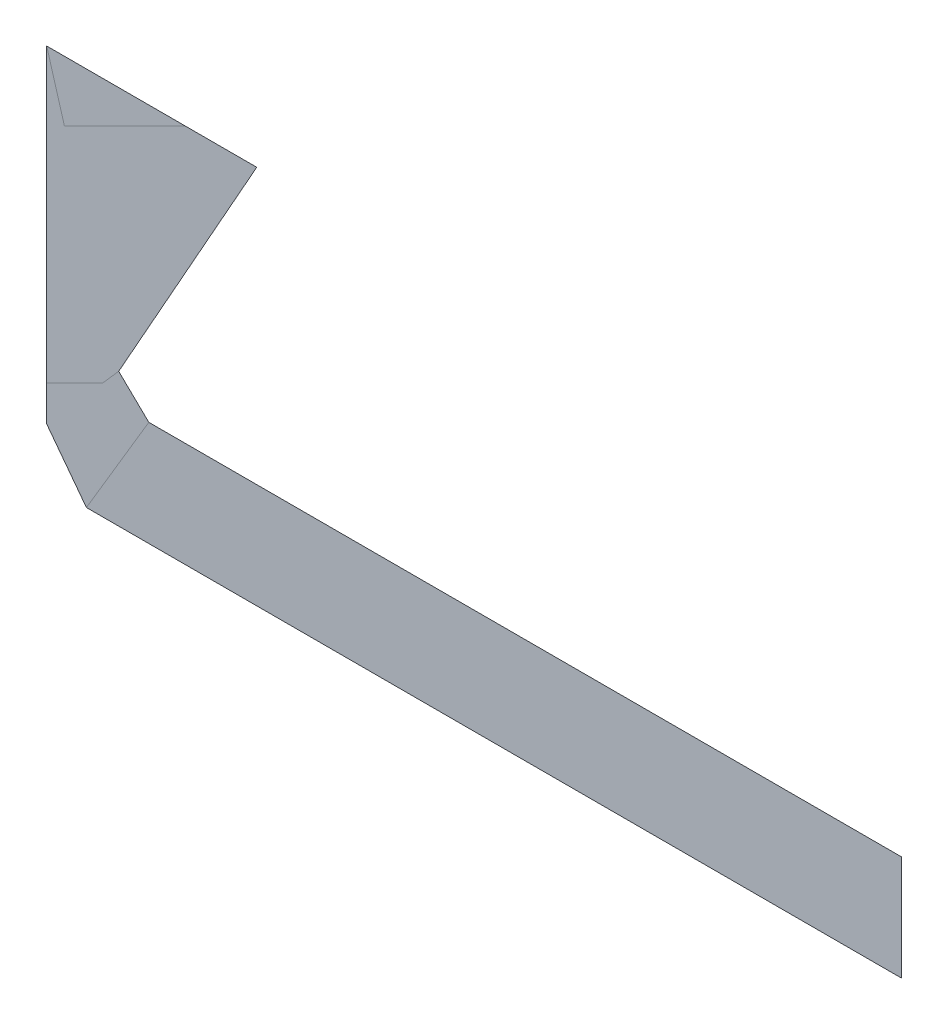
ISO-10303-21;
HEADER;
FILE_DESCRIPTION(('STEP AP214'),'2;1');
FILE_NAME('part.step','',(''),(''),'','','');
FILE_SCHEMA(('AUTOMOTIVE_DESIGN { 1 0 10303 214 1 1 1 1 }'));
ENDSEC;
DATA;
#1=APPLICATION_CONTEXT('core data for automotive mechanical design processes');
#2=APPLICATION_PROTOCOL_DEFINITION('international standard','automotive_design',2000,#1);
#3=PRODUCT_CONTEXT('',#1,'mechanical');
#4=PRODUCT('Part','Part','',(#3));
#5=PRODUCT_RELATED_PRODUCT_CATEGORY('part','',(#4));
#6=PRODUCT_DEFINITION_FORMATION('','',#4);
#7=PRODUCT_DEFINITION_CONTEXT('part definition',#1,'design');
#8=PRODUCT_DEFINITION('design','',#6,#7);
#9=PRODUCT_DEFINITION_SHAPE('','',#8);
#10=(LENGTH_UNIT() NAMED_UNIT(*) SI_UNIT(.MILLI.,.METRE.));
#11=(NAMED_UNIT(*) PLANE_ANGLE_UNIT() SI_UNIT($,.RADIAN.));
#12=(NAMED_UNIT(*) SI_UNIT($,.STERADIAN.) SOLID_ANGLE_UNIT());
#13=UNCERTAINTY_MEASURE_WITH_UNIT(LENGTH_MEASURE(1.E-05),#10,'distance_accuracy_value','');
#14=(GEOMETRIC_REPRESENTATION_CONTEXT(3) GLOBAL_UNCERTAINTY_ASSIGNED_CONTEXT((#13)) GLOBAL_UNIT_ASSIGNED_CONTEXT((#10,
#11,#12)) REPRESENTATION_CONTEXT('',''));
#15=CARTESIAN_POINT('',(0.,0.,0.));
#16=DIRECTION('',(0.,0.,1.));
#17=DIRECTION('',(1.,0.,0.));
#18=AXIS2_PLACEMENT_3D('',#15,#16,#17);
#19=CARTESIAN_POINT('',(5.645839926502,0.703347583591,0.001668));
#20=DIRECTION('',(0.,0.,1.));
#21=DIRECTION('',(1.,0.,0.));
#22=AXIS2_PLACEMENT_3D('',#19,#20,#21);
#23=PLANE('',#22);
#24=CARTESIAN_POINT('',(5.860369157796,0.696738694803,0.001668));
#25=DIRECTION('',(-1.,0.,0.));
#26=VECTOR('',#25,1.);
#27=LINE('',#24,#26);
#28=CARTESIAN_POINT('',(5.860369157796,0.696738694803,0.0015));
#29=VERTEX_POINT('',#28);
#30=CARTESIAN_POINT('',(5.547352927416,0.696738694803,0.0015));
#31=VERTEX_POINT('',#30);
#32=EDGE_CURVE('E138',#29,#31,#27,.T.);
#33=ORIENTED_EDGE('',*,*,#32,.T.);
#34=CARTESIAN_POINT('',(5.547352927416,0.696738694803,0.001668));
#35=DIRECTION('',(-0.718988368379868,0.695022104781175,0.));
#36=VECTOR('',#35,1.);
#37=LINE('',#34,#36);
#38=CARTESIAN_POINT('',(5.534824248743,0.708849751121,0.0015));
#39=VERTEX_POINT('',#38);
#40=EDGE_CURVE('E28',#31,#39,#37,.T.);
#41=ORIENTED_EDGE('',*,*,#40,.T.);
#42=CARTESIAN_POINT('',(5.534824248743,0.708849751121,0.001668));
#43=DIRECTION('',(0.489822399632752,0.871822239231148,0.));
#44=VECTOR('',#43,1.);
#45=LINE('',#42,#44);
#46=CARTESIAN_POINT('',(5.592252953513,0.81106561962,0.0015));
#47=VERTEX_POINT('',#46);
#48=EDGE_CURVE('E11',#39,#47,#45,.T.);
#49=ORIENTED_EDGE('',*,*,#48,.T.);
#50=CARTESIAN_POINT('',(5.592252953513,0.81106561962,0.001668));
#51=DIRECTION('',(-1.,0.,0.));
#52=VECTOR('',#51,1.);
#53=LINE('',#50,#52);
#54=CARTESIAN_POINT('',(5.50488152322,0.81106561962,0.0015));
#55=VERTEX_POINT('',#54);
#56=EDGE_CURVE('E56',#47,#55,#53,.T.);
#57=ORIENTED_EDGE('',*,*,#56,.T.);
#58=CARTESIAN_POINT('',(5.50488152322,0.81106561962,0.001668));
#59=DIRECTION('',(0.,-1.,0.));
#60=VECTOR('',#59,1.);
#61=LINE('',#58,#60);
#62=CARTESIAN_POINT('',(5.50488152322,0.674898417121,0.0015));
#63=VERTEX_POINT('',#62);
#64=EDGE_CURVE('E53',#55,#63,#61,.T.);
#65=ORIENTED_EDGE('',*,*,#64,.T.);
#66=CARTESIAN_POINT('',(5.50488152322,0.674898417121,0.001668));
#67=DIRECTION('',(0.60328667822507,-0.797524409580146,0.));
#68=VECTOR('',#67,1.);
#69=LINE('',#66,#68);
#70=CARTESIAN_POINT('',(5.52140258316,0.653058139439,0.0015));
#71=VERTEX_POINT('',#70);
#72=EDGE_CURVE('E134',#63,#71,#69,.T.);
#73=ORIENTED_EDGE('',*,*,#72,.T.);
#74=CARTESIAN_POINT('',(5.52140258316,0.653058139439,0.001668));
#75=DIRECTION('',(1.,0.,0.));
#76=VECTOR('',#75,1.);
#77=LINE('',#74,#76);
#78=CARTESIAN_POINT('',(5.860369157796,0.653058139439,0.0015));
#79=VERTEX_POINT('',#78);
#80=EDGE_CURVE('E135',#71,#79,#77,.T.);
#81=ORIENTED_EDGE('',*,*,#80,.T.);
#82=CARTESIAN_POINT('',(5.860369157796,0.653058139439,0.001668));
#83=DIRECTION('',(0.,1.,0.));
#84=VECTOR('',#83,1.);
#85=LINE('',#82,#84);
#86=EDGE_CURVE('E136',#79,#29,#85,.T.);
#87=ORIENTED_EDGE('',*,*,#86,.T.);
#88=EDGE_LOOP('',(#33,#41,#49,#57,#65,#73,#81,#87));
#89=FACE_BOUND('',#88,.T.);
#90=ADVANCED_FACE('F17',(#89),#23,.T.);
#91=CARTESIAN_POINT('',(5.645839926502,0.703347583591,0.001332));
#92=DIRECTION('',(0.,0.,1.));
#93=DIRECTION('',(1.,0.,0.));
#94=AXIS2_PLACEMENT_3D('',#91,#92,#93);
#95=PLANE('',#94);
#96=ORIENTED_EDGE('',*,*,#40,.F.);
#97=ORIENTED_EDGE('',*,*,#32,.F.);
#98=ORIENTED_EDGE('',*,*,#86,.F.);
#99=ORIENTED_EDGE('',*,*,#80,.F.);
#100=ORIENTED_EDGE('',*,*,#72,.F.);
#101=ORIENTED_EDGE('',*,*,#64,.F.);
#102=ORIENTED_EDGE('',*,*,#56,.F.);
#103=ORIENTED_EDGE('',*,*,#48,.F.);
#104=EDGE_LOOP('',(#96,#97,#98,#99,#100,#101,#102,#103));
#105=FACE_BOUND('',#104,.T.);
#106=ADVANCED_FACE('F58',(#105),#95,.F.);
#107=CLOSED_SHELL('',(#90,#106));
#108=MANIFOLD_SOLID_BREP('B1',#107);
#109=ADVANCED_BREP_SHAPE_REPRESENTATION('',(#18,#108),#14);
#110=SHAPE_DEFINITION_REPRESENTATION(#9,#109);
ENDSEC;
END-ISO-10303-21;
